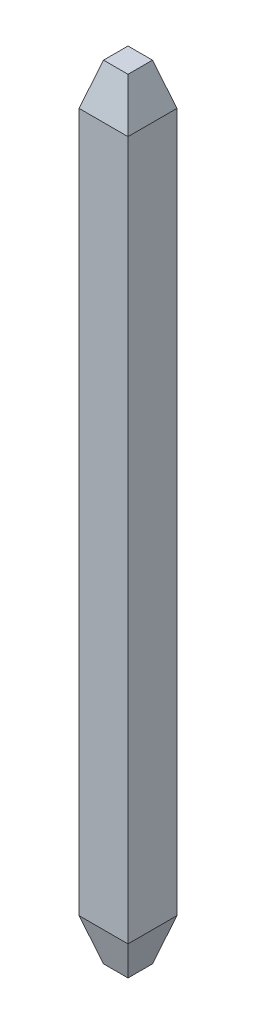
ISO-10303-21;
HEADER;
FILE_DESCRIPTION(('STEP AP214'),'2;1');
FILE_NAME('part.step','',(''),(''),'','','');
FILE_SCHEMA(('AUTOMOTIVE_DESIGN { 1 0 10303 214 1 1 1 1 }'));
ENDSEC;
DATA;
#1=APPLICATION_CONTEXT('core data for automotive mechanical design processes');
#2=APPLICATION_PROTOCOL_DEFINITION('international standard','automotive_design',2000,#1);
#3=PRODUCT_CONTEXT('',#1,'mechanical');
#4=PRODUCT('Part','Part','',(#3));
#5=PRODUCT_RELATED_PRODUCT_CATEGORY('part','',(#4));
#6=PRODUCT_DEFINITION_FORMATION('','',#4);
#7=PRODUCT_DEFINITION_CONTEXT('part definition',#1,'design');
#8=PRODUCT_DEFINITION('design','',#6,#7);
#9=PRODUCT_DEFINITION_SHAPE('','',#8);
#10=(LENGTH_UNIT() NAMED_UNIT(*) SI_UNIT(.MILLI.,.METRE.));
#11=(NAMED_UNIT(*) PLANE_ANGLE_UNIT() SI_UNIT($,.RADIAN.));
#12=(NAMED_UNIT(*) SI_UNIT($,.STERADIAN.) SOLID_ANGLE_UNIT());
#13=UNCERTAINTY_MEASURE_WITH_UNIT(LENGTH_MEASURE(1.E-05),#10,'distance_accuracy_value','');
#14=(GEOMETRIC_REPRESENTATION_CONTEXT(3) GLOBAL_UNCERTAINTY_ASSIGNED_CONTEXT((#13)) GLOBAL_UNIT_ASSIGNED_CONTEXT((#10,
#11,#12)) REPRESENTATION_CONTEXT('',''));
#15=CARTESIAN_POINT('',(0.,0.,0.));
#16=DIRECTION('',(0.,0.,1.));
#17=DIRECTION('',(1.,0.,0.));
#18=AXIS2_PLACEMENT_3D('',#15,#16,#17);
#19=CARTESIAN_POINT('',(-16.349999999987,-10.1039999999832,-16.6599999999763));
#20=DIRECTION('',(0.,-0.281214622974643,0.959644900900968));
#21=DIRECTION('',(-1.,0.,0.));
#22=AXIS2_PLACEMENT_3D('',#19,#20,#21);
#23=PLANE('',#22);
#24=DIRECTION('',(-1.,0.,0.));
#25=VECTOR('',#24,1.);
#26=CARTESIAN_POINT('',(-16.029999999987,-10.1039999999832,-16.6599999999763));
#27=LINE('',#26,#25);
#28=CARTESIAN_POINT('',(-16.029999999987,-10.1039999999832,-16.6599999999763));
#29=VERTEX_POINT('',#28);
#30=CARTESIAN_POINT('',(-16.669999999987,-10.1039999999832,-16.6599999999763));
#31=VERTEX_POINT('',#30);
#32=EDGE_CURVE('E11',#29,#31,#27,.T.);
#33=ORIENTED_EDGE('',*,*,#32,.T.);
#34=DIRECTION('',(0.270714017147727,-0.923811583516618,-0.270714017147727));
#35=VECTOR('',#34,1.);
#36=CARTESIAN_POINT('',(-16.669999999987,-10.1039999999832,-16.6599999999763));
#37=LINE('',#36,#35);
#38=CARTESIAN_POINT('',(-16.509999999987,-10.6499999999832,-16.8199999999763));
#39=VERTEX_POINT('',#38);
#40=EDGE_CURVE('E28',#31,#39,#37,.T.);
#41=ORIENTED_EDGE('',*,*,#40,.T.);
#42=DIRECTION('',(-1.,0.,0.));
#43=VECTOR('',#42,1.);
#44=CARTESIAN_POINT('',(-16.189999999987,-10.6499999999832,-16.8199999999763));
#45=LINE('',#44,#43);
#46=CARTESIAN_POINT('',(-16.189999999987,-10.6499999999832,-16.8199999999763));
#47=VERTEX_POINT('',#46);
#48=EDGE_CURVE('E139',#47,#39,#45,.T.);
#49=ORIENTED_EDGE('',*,*,#48,.F.);
#50=DIRECTION('',(-0.27071401714772,-0.923811583516619,-0.270714017147728));
#51=VECTOR('',#50,1.);
#52=CARTESIAN_POINT('',(-16.029999999987,-10.1039999999832,-16.6599999999763));
#53=LINE('',#52,#51);
#54=EDGE_CURVE('E168',#29,#47,#53,.T.);
#55=ORIENTED_EDGE('',*,*,#54,.F.);
#56=EDGE_LOOP('',(#33,#41,#49,#55));
#57=FACE_BOUND('',#56,.T.);
#58=ADVANCED_FACE('F17',(#57),#23,.T.);
#59=CARTESIAN_POINT('',(-16.670999999987,-5.53543505344796,-16.6599999999763));
#60=DIRECTION('',(0.,0.,1.));
#61=DIRECTION('',(1.,0.,0.));
#62=AXIS2_PLACEMENT_3D('',#59,#60,#61);
#63=PLANE('',#62);
#64=DIRECTION('',(0.,1.,0.));
#65=VECTOR('',#64,1.);
#66=CARTESIAN_POINT('',(-16.669999999987,-10.1039999999832,-16.6599999999763));
#67=LINE('',#66,#65);
#68=CARTESIAN_POINT('',(-16.669999999987,-0.965870106912723,-16.6599999999763));
#69=VERTEX_POINT('',#68);
#70=EDGE_CURVE('E42',#31,#69,#67,.T.);
#71=ORIENTED_EDGE('',*,*,#70,.F.);
#72=ORIENTED_EDGE('',*,*,#32,.F.);
#73=DIRECTION('',(0.,1.,0.));
#74=VECTOR('',#73,1.);
#75=CARTESIAN_POINT('',(-16.029999999987,-10.1039999999832,-16.6599999999763));
#76=LINE('',#75,#74);
#77=CARTESIAN_POINT('',(-16.029999999987,-0.965870106912723,-16.6599999999763));
#78=VERTEX_POINT('',#77);
#79=EDGE_CURVE('E152',#29,#78,#76,.T.);
#80=ORIENTED_EDGE('',*,*,#79,.T.);
#81=DIRECTION('',(-1.,0.,0.));
#82=VECTOR('',#81,1.);
#83=CARTESIAN_POINT('',(-16.029999999987,-0.965870106912721,-16.6599999999763));
#84=LINE('',#83,#82);
#85=EDGE_CURVE('E156',#78,#69,#84,.T.);
#86=ORIENTED_EDGE('',*,*,#85,.T.);
#87=EDGE_LOOP('',(#71,#72,#80,#86));
#88=FACE_BOUND('',#87,.T.);
#89=ADVANCED_FACE('F359',(#88),#63,.T.);
#90=CARTESIAN_POINT('',(-16.669999999987,-5.53543505344796,-16.6589999999763));
#91=DIRECTION('',(-1.,0.,0.));
#92=DIRECTION('',(0.,0.,1.));
#93=AXIS2_PLACEMENT_3D('',#90,#91,#92);
#94=PLANE('',#93);
#95=DIRECTION('',(0.,1.,0.));
#96=VECTOR('',#95,1.);
#97=CARTESIAN_POINT('',(-16.669999999987,-10.1039999999832,-17.2999999999763));
#98=LINE('',#97,#96);
#99=CARTESIAN_POINT('',(-16.669999999987,-10.1039999999832,-17.2999999999763));
#100=VERTEX_POINT('',#99);
#101=CARTESIAN_POINT('',(-16.669999999987,-0.965870106912723,-17.2999999999763));
#102=VERTEX_POINT('',#101);
#103=EDGE_CURVE('E175',#100,#102,#98,.T.);
#104=ORIENTED_EDGE('',*,*,#103,.F.);
#105=DIRECTION('',(0.,0.,-1.));
#106=VECTOR('',#105,1.);
#107=CARTESIAN_POINT('',(-16.669999999987,-10.1039999999832,-16.6599999999763));
#108=LINE('',#107,#106);
#109=EDGE_CURVE('E121',#31,#100,#108,.T.);
#110=ORIENTED_EDGE('',*,*,#109,.F.);
#111=ORIENTED_EDGE('',*,*,#70,.T.);
#112=DIRECTION('',(0.,0.,-1.));
#113=VECTOR('',#112,1.);
#114=CARTESIAN_POINT('',(-16.669999999987,-0.965870106912721,-16.6599999999763));
#115=LINE('',#114,#113);
#116=EDGE_CURVE('E158',#69,#102,#115,.T.);
#117=ORIENTED_EDGE('',*,*,#116,.T.);
#118=EDGE_LOOP('',(#104,#110,#111,#117));
#119=FACE_BOUND('',#118,.T.);
#120=ADVANCED_FACE('F354',(#119),#94,.T.);
#121=CARTESIAN_POINT('',(-16.028999999987,-5.53443505344796,-17.2999999999763));
#122=DIRECTION('',(0.,0.,-1.));
#123=DIRECTION('',(0.,-1.,0.));
#124=AXIS2_PLACEMENT_3D('',#121,#122,#123);
#125=PLANE('',#124);
#126=DIRECTION('',(0.,1.,0.));
#127=VECTOR('',#126,1.);
#128=CARTESIAN_POINT('',(-16.029999999987,-10.1039999999832,-17.2999999999763));
#129=LINE('',#128,#127);
#130=CARTESIAN_POINT('',(-16.029999999987,-10.1039999999832,-17.2999999999763));
#131=VERTEX_POINT('',#130);
#132=CARTESIAN_POINT('',(-16.029999999987,-0.965870106912723,-17.2999999999763));
#133=VERTEX_POINT('',#132);
#134=EDGE_CURVE('E79',#131,#133,#129,.T.);
#135=ORIENTED_EDGE('',*,*,#134,.F.);
#136=DIRECTION('',(1.,0.,0.));
#137=VECTOR('',#136,1.);
#138=CARTESIAN_POINT('',(-16.669999999987,-10.1039999999832,-17.2999999999763));
#139=LINE('',#138,#137);
#140=EDGE_CURVE('E165',#100,#131,#139,.T.);
#141=ORIENTED_EDGE('',*,*,#140,.F.);
#142=ORIENTED_EDGE('',*,*,#103,.T.);
#143=DIRECTION('',(1.,0.,0.));
#144=VECTOR('',#143,1.);
#145=CARTESIAN_POINT('',(-16.669999999987,-0.965870106912721,-17.2999999999763));
#146=LINE('',#145,#144);
#147=EDGE_CURVE('E172',#102,#133,#146,.T.);
#148=ORIENTED_EDGE('',*,*,#147,.T.);
#149=EDGE_LOOP('',(#135,#141,#142,#148));
#150=FACE_BOUND('',#149,.T.);
#151=ADVANCED_FACE('F19',(#150),#125,.T.);
#152=CARTESIAN_POINT('',(-16.349999999987,-0.965870106912721,-17.2999999999763));
#153=DIRECTION('',(0.,0.281214622974643,-0.959644900900968));
#154=DIRECTION('',(-1.,0.,0.));
#155=AXIS2_PLACEMENT_3D('',#152,#153,#154);
#156=PLANE('',#155);
#157=DIRECTION('',(0.270714017147727,0.923811583516617,0.270714017147727));
#158=VECTOR('',#157,1.);
#159=CARTESIAN_POINT('',(-16.669999999987,-0.965870106912721,-17.2999999999763));
#160=LINE('',#159,#158);
#161=CARTESIAN_POINT('',(-16.509999999987,-0.419870106912724,-17.1399999999763));
#162=VERTEX_POINT('',#161);
#163=EDGE_CURVE('E176',#102,#162,#160,.T.);
#164=ORIENTED_EDGE('',*,*,#163,.T.);
#165=DIRECTION('',(1.,0.,0.));
#166=VECTOR('',#165,1.);
#167=CARTESIAN_POINT('',(-16.509999999987,-0.419870106912722,-17.1399999999763));
#168=LINE('',#167,#166);
#169=CARTESIAN_POINT('',(-16.189999999987,-0.419870106912724,-17.1399999999763));
#170=VERTEX_POINT('',#169);
#171=EDGE_CURVE('E91',#162,#170,#168,.T.);
#172=ORIENTED_EDGE('',*,*,#171,.T.);
#173=DIRECTION('',(-0.27071401714772,0.923811583516619,0.270714017147728));
#174=VECTOR('',#173,1.);
#175=CARTESIAN_POINT('',(-16.029999999987,-0.965870106912721,-17.2999999999763));
#176=LINE('',#175,#174);
#177=EDGE_CURVE('E164',#133,#170,#176,.T.);
#178=ORIENTED_EDGE('',*,*,#177,.F.);
#179=ORIENTED_EDGE('',*,*,#147,.F.);
#180=EDGE_LOOP('',(#164,#172,#178,#179));
#181=FACE_BOUND('',#180,.T.);
#182=ADVANCED_FACE('F340',(#181),#156,.T.);
#183=CARTESIAN_POINT('',(-16.029999999987,-0.965870106912721,-16.9799999999763));
#184=DIRECTION('',(0.95964490090097,0.281214622974636,0.));
#185=DIRECTION('',(0.,0.,-1.));
#186=AXIS2_PLACEMENT_3D('',#183,#184,#185);
#187=PLANE('',#186);
#188=ORIENTED_EDGE('',*,*,#177,.T.);
#189=DIRECTION('',(0.,0.,1.));
#190=VECTOR('',#189,1.);
#191=CARTESIAN_POINT('',(-16.189999999987,-0.419870106912722,-17.1399999999763));
#192=LINE('',#191,#190);
#193=CARTESIAN_POINT('',(-16.189999999987,-0.419870106912724,-16.8199999999763));
#194=VERTEX_POINT('',#193);
#195=EDGE_CURVE('E160',#170,#194,#192,.T.);
#196=ORIENTED_EDGE('',*,*,#195,.T.);
#197=DIRECTION('',(-0.27071401714772,0.923811583516619,-0.270714017147728));
#198=VECTOR('',#197,1.);
#199=CARTESIAN_POINT('',(-16.029999999987,-0.965870106912721,-16.6599999999763));
#200=LINE('',#199,#198);
#201=EDGE_CURVE('E171',#78,#194,#200,.T.);
#202=ORIENTED_EDGE('',*,*,#201,.F.);
#203=DIRECTION('',(0.,0.,1.));
#204=VECTOR('',#203,1.);
#205=CARTESIAN_POINT('',(-16.029999999987,-0.965870106912721,-17.2999999999763));
#206=LINE('',#205,#204);
#207=EDGE_CURVE('E199',#133,#78,#206,.T.);
#208=ORIENTED_EDGE('',*,*,#207,.F.);
#209=EDGE_LOOP('',(#188,#196,#202,#208));
#210=FACE_BOUND('',#209,.T.);
#211=ADVANCED_FACE('F334',(#210),#187,.T.);
#212=CARTESIAN_POINT('',(-16.349999999987,-0.419870106912722,-17.1409999999763));
#213=DIRECTION('',(0.,1.,0.));
#214=DIRECTION('',(1.,0.,0.));
#215=AXIS2_PLACEMENT_3D('',#212,#213,#214);
#216=PLANE('',#215);
#217=ORIENTED_EDGE('',*,*,#171,.F.);
#218=DIRECTION('',(0.,0.,-1.));
#219=VECTOR('',#218,1.);
#220=CARTESIAN_POINT('',(-16.509999999987,-0.419870106912722,-16.8199999999763));
#221=LINE('',#220,#219);
#222=CARTESIAN_POINT('',(-16.509999999987,-0.419870106912724,-16.8199999999763));
#223=VERTEX_POINT('',#222);
#224=EDGE_CURVE('E209',#223,#162,#221,.T.);
#225=ORIENTED_EDGE('',*,*,#224,.F.);
#226=DIRECTION('',(-1.,0.,0.));
#227=VECTOR('',#226,1.);
#228=CARTESIAN_POINT('',(-16.189999999987,-0.419870106912722,-16.8199999999763));
#229=LINE('',#228,#227);
#230=EDGE_CURVE('E169',#194,#223,#229,.T.);
#231=ORIENTED_EDGE('',*,*,#230,.F.);
#232=ORIENTED_EDGE('',*,*,#195,.F.);
#233=EDGE_LOOP('',(#217,#225,#231,#232));
#234=FACE_BOUND('',#233,.T.);
#235=ADVANCED_FACE('F339',(#234),#216,.T.);
#236=CARTESIAN_POINT('',(-16.349999999987,-10.1039999999832,-17.2999999999763));
#237=DIRECTION('',(0.,-0.281214622974643,-0.959644900900968));
#238=DIRECTION('',(0.,-0.959644900900968,0.281214622974643));
#239=AXIS2_PLACEMENT_3D('',#236,#237,#238);
#240=PLANE('',#239);
#241=ORIENTED_EDGE('',*,*,#140,.T.);
#242=DIRECTION('',(-0.27071401714772,-0.923811583516619,0.270714017147728));
#243=VECTOR('',#242,1.);
#244=CARTESIAN_POINT('',(-16.029999999987,-10.1039999999832,-17.2999999999763));
#245=LINE('',#244,#243);
#246=CARTESIAN_POINT('',(-16.189999999987,-10.6499999999832,-17.1399999999763));
#247=VERTEX_POINT('',#246);
#248=EDGE_CURVE('E131',#131,#247,#245,.T.);
#249=ORIENTED_EDGE('',*,*,#248,.T.);
#250=DIRECTION('',(1.,0.,0.));
#251=VECTOR('',#250,1.);
#252=CARTESIAN_POINT('',(-16.509999999987,-10.6499999999832,-17.1399999999763));
#253=LINE('',#252,#251);
#254=CARTESIAN_POINT('',(-16.509999999987,-10.6499999999832,-17.1399999999763));
#255=VERTEX_POINT('',#254);
#256=EDGE_CURVE('E128',#255,#247,#253,.T.);
#257=ORIENTED_EDGE('',*,*,#256,.F.);
#258=DIRECTION('',(0.270714017147727,-0.923811583516618,0.270714017147727));
#259=VECTOR('',#258,1.);
#260=CARTESIAN_POINT('',(-16.669999999987,-10.1039999999832,-17.2999999999763));
#261=LINE('',#260,#259);
#262=EDGE_CURVE('E115',#100,#255,#261,.T.);
#263=ORIENTED_EDGE('',*,*,#262,.F.);
#264=EDGE_LOOP('',(#241,#249,#257,#263));
#265=FACE_BOUND('',#264,.T.);
#266=ADVANCED_FACE('F129',(#265),#240,.T.);
#267=CARTESIAN_POINT('',(-16.669999999987,-0.965870106912721,-16.9799999999763));
#268=DIRECTION('',(-0.959644900900968,0.281214622974643,0.));
#269=DIRECTION('',(0.,0.,1.));
#270=AXIS2_PLACEMENT_3D('',#267,#268,#269);
#271=PLANE('',#270);
#272=DIRECTION('',(0.270714017147727,0.923811583516617,-0.270714017147727));
#273=VECTOR('',#272,1.);
#274=CARTESIAN_POINT('',(-16.669999999987,-0.965870106912721,-16.6599999999763));
#275=LINE('',#274,#273);
#276=EDGE_CURVE('E21',#69,#223,#275,.T.);
#277=ORIENTED_EDGE('',*,*,#276,.T.);
#278=ORIENTED_EDGE('',*,*,#224,.T.);
#279=ORIENTED_EDGE('',*,*,#163,.F.);
#280=ORIENTED_EDGE('',*,*,#116,.F.);
#281=EDGE_LOOP('',(#277,#278,#279,#280));
#282=FACE_BOUND('',#281,.T.);
#283=ADVANCED_FACE('F313',(#282),#271,.T.);
#284=CARTESIAN_POINT('',(-16.349999999987,-0.965870106912721,-16.6599999999763));
#285=DIRECTION('',(0.,0.281214622974643,0.959644900900968));
#286=DIRECTION('',(1.,0.,0.));
#287=AXIS2_PLACEMENT_3D('',#284,#285,#286);
#288=PLANE('',#287);
#289=ORIENTED_EDGE('',*,*,#201,.T.);
#290=ORIENTED_EDGE('',*,*,#230,.T.);
#291=ORIENTED_EDGE('',*,*,#276,.F.);
#292=ORIENTED_EDGE('',*,*,#85,.F.);
#293=EDGE_LOOP('',(#289,#290,#291,#292));
#294=FACE_BOUND('',#293,.T.);
#295=ADVANCED_FACE('F308',(#294),#288,.T.);
#296=CARTESIAN_POINT('',(-16.029999999987,-11.0738701069127,-16.9799999999763));
#297=DIRECTION('',(1.,0.,0.));
#298=DIRECTION('',(0.,1.,0.));
#299=AXIS2_PLACEMENT_3D('',#296,#297,#298);
#300=PLANE('',#299);
#301=ORIENTED_EDGE('',*,*,#79,.F.);
#302=DIRECTION('',(0.,0.,1.));
#303=VECTOR('',#302,1.);
#304=CARTESIAN_POINT('',(-16.029999999987,-10.1039999999832,-17.2999999999763));
#305=LINE('',#304,#303);
#306=EDGE_CURVE('E202',#131,#29,#305,.T.);
#307=ORIENTED_EDGE('',*,*,#306,.F.);
#308=ORIENTED_EDGE('',*,*,#134,.T.);
#309=ORIENTED_EDGE('',*,*,#207,.T.);
#310=EDGE_LOOP('',(#301,#307,#308,#309));
#311=FACE_BOUND('',#310,.T.);
#312=ADVANCED_FACE('F220',(#311),#300,.T.);
#313=CARTESIAN_POINT('',(-16.029999999987,-10.1039999999832,-16.9799999999763));
#314=DIRECTION('',(0.95964490090097,-0.281214622974636,0.));
#315=DIRECTION('',(0.,0.,-1.));
#316=AXIS2_PLACEMENT_3D('',#313,#314,#315);
#317=PLANE('',#316);
#318=ORIENTED_EDGE('',*,*,#306,.T.);
#319=ORIENTED_EDGE('',*,*,#54,.T.);
#320=DIRECTION('',(0.,0.,1.));
#321=VECTOR('',#320,1.);
#322=CARTESIAN_POINT('',(-16.189999999987,-10.6499999999832,-17.1399999999763));
#323=LINE('',#322,#321);
#324=EDGE_CURVE('E147',#247,#47,#323,.T.);
#325=ORIENTED_EDGE('',*,*,#324,.F.);
#326=ORIENTED_EDGE('',*,*,#248,.F.);
#327=EDGE_LOOP('',(#318,#319,#325,#326));
#328=FACE_BOUND('',#327,.T.);
#329=ADVANCED_FACE('F223',(#328),#317,.T.);
#330=CARTESIAN_POINT('',(-16.510999999987,-10.6499999999832,-16.9799999999763));
#331=DIRECTION('',(0.,-1.,0.));
#332=DIRECTION('',(0.,0.,-1.));
#333=AXIS2_PLACEMENT_3D('',#330,#331,#332);
#334=PLANE('',#333);
#335=ORIENTED_EDGE('',*,*,#324,.T.);
#336=ORIENTED_EDGE('',*,*,#48,.T.);
#337=DIRECTION('',(0.,0.,-1.));
#338=VECTOR('',#337,1.);
#339=CARTESIAN_POINT('',(-16.509999999987,-10.6499999999832,-16.8199999999763));
#340=LINE('',#339,#338);
#341=EDGE_CURVE('E119',#39,#255,#340,.T.);
#342=ORIENTED_EDGE('',*,*,#341,.T.);
#343=ORIENTED_EDGE('',*,*,#256,.T.);
#344=EDGE_LOOP('',(#335,#336,#342,#343));
#345=FACE_BOUND('',#344,.T.);
#346=ADVANCED_FACE('F137',(#345),#334,.T.);
#347=CARTESIAN_POINT('',(-16.669999999987,-10.1039999999832,-16.9799999999763));
#348=DIRECTION('',(-0.959644900900968,-0.281214622974643,0.));
#349=DIRECTION('',(-0.281214622974643,0.959644900900968,0.));
#350=AXIS2_PLACEMENT_3D('',#347,#348,#349);
#351=PLANE('',#350);
#352=ORIENTED_EDGE('',*,*,#109,.T.);
#353=ORIENTED_EDGE('',*,*,#262,.T.);
#354=ORIENTED_EDGE('',*,*,#341,.F.);
#355=ORIENTED_EDGE('',*,*,#40,.F.);
#356=EDGE_LOOP('',(#352,#353,#354,#355));
#357=FACE_BOUND('',#356,.T.);
#358=ADVANCED_FACE('F117',(#357),#351,.T.);
#359=CLOSED_SHELL('',(#58,#89,#120,#151,#182,#211,#235,#266,#283,#295,#312,#329,#346,#358));
#360=MANIFOLD_SOLID_BREP('B1',#359);
#361=ADVANCED_BREP_SHAPE_REPRESENTATION('',(#18,#360),#14);
#362=SHAPE_DEFINITION_REPRESENTATION(#9,#361);
ENDSEC;
END-ISO-10303-21;
